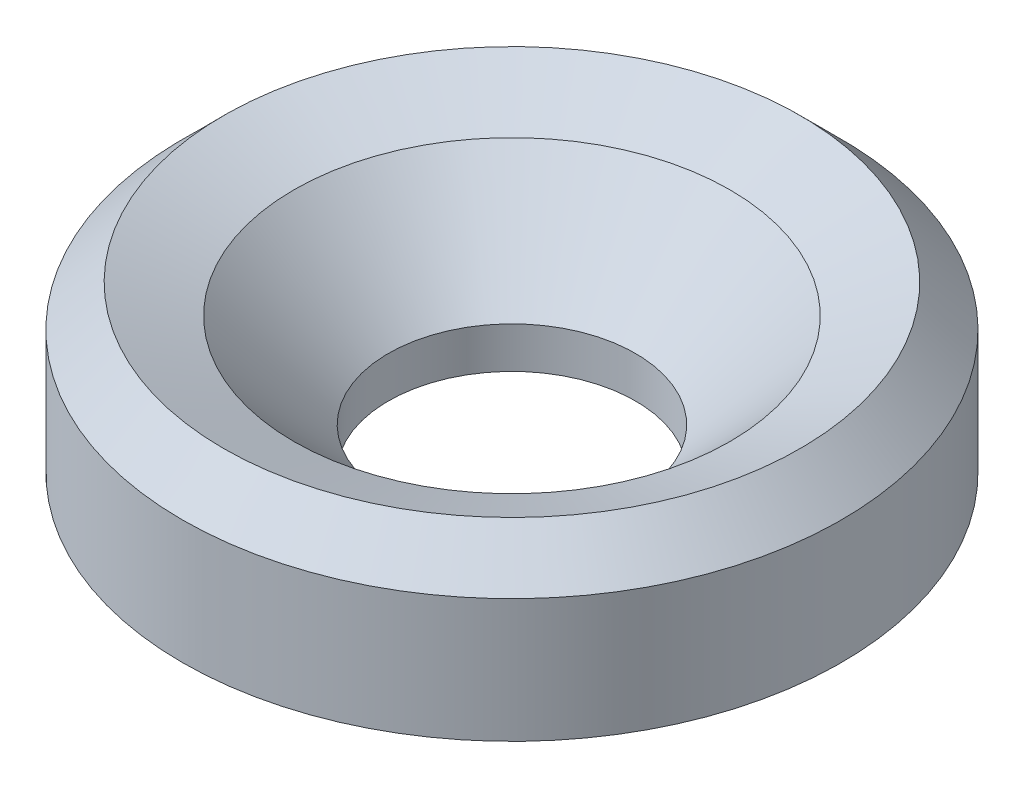
ISO-10303-21;
HEADER;
FILE_DESCRIPTION(('STEP AP214'),'2;1');
FILE_NAME('part.step','',(''),(''),'','','');
FILE_SCHEMA(('AUTOMOTIVE_DESIGN { 1 0 10303 214 1 1 1 1 }'));
ENDSEC;
DATA;
#1=APPLICATION_CONTEXT('core data for automotive mechanical design processes');
#2=APPLICATION_PROTOCOL_DEFINITION('international standard','automotive_design',2000,#1);
#3=PRODUCT_CONTEXT('',#1,'mechanical');
#4=PRODUCT('Part','Part','',(#3));
#5=PRODUCT_RELATED_PRODUCT_CATEGORY('part','',(#4));
#6=PRODUCT_DEFINITION_FORMATION('','',#4);
#7=PRODUCT_DEFINITION_CONTEXT('part definition',#1,'design');
#8=PRODUCT_DEFINITION('design','',#6,#7);
#9=PRODUCT_DEFINITION_SHAPE('','',#8);
#10=(LENGTH_UNIT() NAMED_UNIT(*) SI_UNIT(.MILLI.,.METRE.));
#11=(NAMED_UNIT(*) PLANE_ANGLE_UNIT() SI_UNIT($,.RADIAN.));
#12=(NAMED_UNIT(*) SI_UNIT($,.STERADIAN.) SOLID_ANGLE_UNIT());
#13=UNCERTAINTY_MEASURE_WITH_UNIT(LENGTH_MEASURE(1.E-05),#10,'distance_accuracy_value','');
#14=(GEOMETRIC_REPRESENTATION_CONTEXT(3) GLOBAL_UNCERTAINTY_ASSIGNED_CONTEXT((#13)) GLOBAL_UNIT_ASSIGNED_CONTEXT((#10,
#11,#12)) REPRESENTATION_CONTEXT('',''));
#15=CARTESIAN_POINT('',(0.,0.,0.));
#16=DIRECTION('',(0.,0.,1.));
#17=DIRECTION('',(1.,0.,0.));
#18=AXIS2_PLACEMENT_3D('',#15,#16,#17);
#19=CARTESIAN_POINT('',(0.,2.,0.));
#20=DIRECTION('',(0.,-1.,0.));
#21=DIRECTION('',(0.,0.,-1.));
#22=AXIS2_PLACEMENT_3D('',#19,#20,#21);
#23=CYLINDRICAL_SURFACE('',#22,4.);
#24=CARTESIAN_POINT('',(0.,1.5,0.));
#25=DIRECTION('',(0.,1.,0.));
#26=DIRECTION('',(0.,0.,1.));
#27=AXIS2_PLACEMENT_3D('',#24,#25,#26);
#28=CIRCLE('',#27,4.);
#29=CARTESIAN_POINT('',(0.,1.5,4.));
#30=VERTEX_POINT('',#29);
#31=EDGE_CURVE('E51',#30,#30,#28,.F.);
#32=ORIENTED_EDGE('',*,*,#31,.T.);
#33=EDGE_LOOP('',(#32));
#34=FACE_BOUND('',#33,.T.);
#35=CARTESIAN_POINT('',(0.,0.,0.));
#36=DIRECTION('',(0.,1.,0.));
#37=DIRECTION('',(0.,0.,1.));
#38=AXIS2_PLACEMENT_3D('',#35,#36,#37);
#39=CIRCLE('',#38,4.);
#40=CARTESIAN_POINT('',(0.,0.,4.));
#41=VERTEX_POINT('',#40);
#42=EDGE_CURVE('E62',#41,#41,#39,.T.);
#43=ORIENTED_EDGE('',*,*,#42,.T.);
#44=EDGE_LOOP('',(#43));
#45=FACE_BOUND('',#44,.T.);
#46=ADVANCED_FACE('F41',(#34,#45),#23,.T.);
#47=CARTESIAN_POINT('',(0.,0.,0.));
#48=DIRECTION('',(0.,1.,0.));
#49=DIRECTION('',(0.,0.,1.));
#50=AXIS2_PLACEMENT_3D('',#47,#48,#49);
#51=PLANE('',#50);
#52=CARTESIAN_POINT('',(0.,0.,0.));
#53=DIRECTION('',(0.,1.,0.));
#54=DIRECTION('',(0.,0.,1.));
#55=AXIS2_PLACEMENT_3D('',#52,#53,#54);
#56=CIRCLE('',#55,1.5);
#57=CARTESIAN_POINT('',(0.,0.,1.5));
#58=VERTEX_POINT('',#57);
#59=EDGE_CURVE('E66',#58,#58,#56,.T.);
#60=ORIENTED_EDGE('',*,*,#59,.T.);
#61=EDGE_LOOP('',(#60));
#62=FACE_BOUND('',#61,.T.);
#63=ORIENTED_EDGE('',*,*,#42,.F.);
#64=EDGE_LOOP('',(#63));
#65=FACE_BOUND('',#64,.T.);
#66=ADVANCED_FACE('F88',(#62,#65),#51,.F.);
#67=CARTESIAN_POINT('',(0.,0.,0.));
#68=DIRECTION('',(0.,1.,0.));
#69=DIRECTION('',(0.,0.,1.));
#70=AXIS2_PLACEMENT_3D('',#67,#68,#69);
#71=CYLINDRICAL_SURFACE('',#70,1.5);
#72=CARTESIAN_POINT('',(0.,0.499999999999991,0.));
#73=DIRECTION('',(0.,1.,0.));
#74=DIRECTION('',(0.,0.,1.));
#75=AXIS2_PLACEMENT_3D('',#72,#73,#74);
#76=CIRCLE('',#75,1.5);
#77=CARTESIAN_POINT('',(0.,0.499999999999991,1.5));
#78=VERTEX_POINT('',#77);
#79=EDGE_CURVE('E56',#78,#78,#76,.T.);
#80=ORIENTED_EDGE('',*,*,#79,.T.);
#81=EDGE_LOOP('',(#80));
#82=FACE_BOUND('',#81,.T.);
#83=ORIENTED_EDGE('',*,*,#59,.F.);
#84=EDGE_LOOP('',(#83));
#85=FACE_BOUND('',#84,.T.);
#86=ADVANCED_FACE('F85',(#82,#85),#71,.F.);
#87=CARTESIAN_POINT('',(0.,0.499999999999991,0.));
#88=DIRECTION('',(0.,1.,0.));
#89=DIRECTION('',(0.,0.,1.));
#90=AXIS2_PLACEMENT_3D('',#87,#88,#89);
#91=CONICAL_SURFACE('',#90,1.5,0.785398163397449);
#92=CARTESIAN_POINT('',(0.,1.64644660940672,0.));
#93=DIRECTION('',(0.,-1.,0.));
#94=DIRECTION('',(0.,0.,-1.));
#95=AXIS2_PLACEMENT_3D('',#92,#93,#94);
#96=CIRCLE('',#95,2.64644660940673);
#97=CARTESIAN_POINT('',(0.,1.64644660940672,2.64644660940673));
#98=VERTEX_POINT('',#97);
#99=EDGE_CURVE('E10',#98,#98,#96,.F.);
#100=CARTESIAN_POINT('',(0.,1.64644660940672,2.64644660940673));
#101=CARTESIAN_POINT('',(0.,1.6345044572254,2.63450445722541));
#102=CARTESIAN_POINT('',(0.,1.62256230504408,2.62256230504409));
#103=CARTESIAN_POINT('',(0.,1.59867800068144,2.59867800068145));
#104=CARTESIAN_POINT('',(0.,1.58673584850012,2.58673584850013));
#105=CARTESIAN_POINT('',(0.,1.56285154413748,2.56285154413749));
#106=CARTESIAN_POINT('',(0.,1.55090939195616,2.55090939195617));
#107=CARTESIAN_POINT('',(0.,1.52702508759352,2.52702508759353));
#108=CARTESIAN_POINT('',(0.,1.5150829354122,2.51508293541221));
#109=CARTESIAN_POINT('',(0.,1.49119863104956,2.49119863104957));
#110=CARTESIAN_POINT('',(0.,1.47925647886824,2.47925647886825));
#111=CARTESIAN_POINT('',(0.,1.4553721745056,2.45537217450561));
#112=CARTESIAN_POINT('',(0.,1.44343002232428,2.44343002232429));
#113=CARTESIAN_POINT('',(0.,1.41954571796164,2.41954571796165));
#114=CARTESIAN_POINT('',(0.,1.40760356578032,2.40760356578033));
#115=CARTESIAN_POINT('',(0.,1.38371926141768,2.38371926141769));
#116=CARTESIAN_POINT('',(0.,1.37177710923636,2.37177710923637));
#117=CARTESIAN_POINT('',(0.,1.34789280487372,2.34789280487373));
#118=CARTESIAN_POINT('',(0.,1.3359506526924,2.33595065269241));
#119=CARTESIAN_POINT('',(0.,1.31206634832976,2.31206634832977));
#120=CARTESIAN_POINT('',(0.,1.30012419614844,2.30012419614845));
#121=CARTESIAN_POINT('',(0.,1.2762398917858,2.27623989178581));
#122=CARTESIAN_POINT('',(0.,1.26429773960448,2.26429773960449));
#123=CARTESIAN_POINT('',(0.,1.24041343524184,2.24041343524185));
#124=CARTESIAN_POINT('',(0.,1.22847128306052,2.22847128306053));
#125=CARTESIAN_POINT('',(0.,1.20458697869788,2.20458697869789));
#126=CARTESIAN_POINT('',(0.,1.19264482651656,2.19264482651657));
#127=CARTESIAN_POINT('',(0.,1.16876052215392,2.16876052215393));
#128=CARTESIAN_POINT('',(0.,1.1568183699726,2.15681836997261));
#129=CARTESIAN_POINT('',(0.,1.13293406560996,2.13293406560997));
#130=CARTESIAN_POINT('',(0.,1.12099191342864,2.12099191342865));
#131=CARTESIAN_POINT('',(0.,1.097107609066,2.09710760906601));
#132=CARTESIAN_POINT('',(0.,1.08516545688468,2.08516545688469));
#133=CARTESIAN_POINT('',(0.,1.06128115252204,2.06128115252205));
#134=CARTESIAN_POINT('',(0.,1.04933900034072,2.04933900034073));
#135=CARTESIAN_POINT('',(0.,1.02545469597808,2.02545469597809));
#136=CARTESIAN_POINT('',(0.,1.01351254379676,2.01351254379677));
#137=CARTESIAN_POINT('',(0.,0.989628239434117,1.98962823943413));
#138=CARTESIAN_POINT('',(0.,0.977686087252796,1.97768608725281));
#139=CARTESIAN_POINT('',(0.,0.953801782890156,1.95380178289017));
#140=CARTESIAN_POINT('',(0.,0.941859630708836,1.94185963070885));
#141=CARTESIAN_POINT('',(0.,0.917975326346196,1.91797532634621));
#142=CARTESIAN_POINT('',(0.,0.906033174164876,1.90603317416488));
#143=CARTESIAN_POINT('',(0.,0.882148869802236,1.88214886980224));
#144=CARTESIAN_POINT('',(0.,0.870206717620915,1.87020671762092));
#145=CARTESIAN_POINT('',(0.,0.846322413258275,1.84632241325828));
#146=CARTESIAN_POINT('',(0.,0.834380261076955,1.83438026107696));
#147=CARTESIAN_POINT('',(0.,0.810495956714315,1.81049595671432));
#148=CARTESIAN_POINT('',(0.,0.798553804532995,1.798553804533));
#149=CARTESIAN_POINT('',(0.,0.774669500170354,1.77466950017036));
#150=CARTESIAN_POINT('',(0.,0.762727347989034,1.76272734798904));
#151=CARTESIAN_POINT('',(0.,0.738843043626394,1.7388430436264));
#152=CARTESIAN_POINT('',(0.,0.726900891445074,1.72690089144508));
#153=CARTESIAN_POINT('',(0.,0.703016587082434,1.70301658708244));
#154=CARTESIAN_POINT('',(0.,0.691074434901113,1.69107443490112));
#155=CARTESIAN_POINT('',(0.,0.667190130538473,1.66719013053848));
#156=CARTESIAN_POINT('',(0.,0.655247978357153,1.65524797835716));
#157=CARTESIAN_POINT('',(0.,0.631363673994513,1.63136367399452));
#158=CARTESIAN_POINT('',(0.,0.619421521813192,1.6194215218132));
#159=CARTESIAN_POINT('',(0.,0.595537217450552,1.59553721745056));
#160=CARTESIAN_POINT('',(0.,0.583595065269232,1.58359506526924));
#161=CARTESIAN_POINT('',(0.,0.559710760906592,1.5597107609066));
#162=CARTESIAN_POINT('',(0.,0.547768608725272,1.54776860872528));
#163=CARTESIAN_POINT('',(0.,0.523884304362631,1.52388430436264));
#164=CARTESIAN_POINT('',(0.,0.511942152181311,1.51194215218132));
#165=CARTESIAN_POINT('',(0.,0.499999999999991,1.5));
#166=B_SPLINE_CURVE_WITH_KNOTS('',3,(#100,#101,#102,#103,#104,#105,#106,#107,#108,#109,#110,
#111,#112,#113,#114,#115,#116,#117,#118,#119,#120,#121,#122,#123,#124,#125,#126,#127,#128,#129,
#130,#131,#132,#133,#134,#135,#136,#137,#138,#139,#140,#141,#142,#143,#144,#145,#146,#147,#148,
#149,#150,#151,#152,#153,#154,#155,#156,#157,#158,#159,#160,#161,#162,#163,#164,#165),
.UNSPECIFIED.,.F.,.F.,(4,2,2,2,2,2,2,2,2,2,2,2,2,2,2,2,2,2,2,2,2,2,2,2,2,2,2,2,2,2,2,2,4),(0.,
0.0506662607362394,0.101332521472478,0.151998782208717,0.202665042944956,0.253331303681195,
0.303997564417435,0.354663825153674,0.405330085889913,0.455996346626152,0.506662607362391,
0.55732886809863,0.60799512883487,0.658661389571109,0.709327650307348,0.759993911043587,
0.810660171779826,0.861326432516065,0.911992693252304,0.962658953988544,1.01332521472478,
1.06399147546102,1.11465773619726,1.1653239969335,1.21599025766974,1.26665651840598,
1.31732277914222,1.36798903987846,1.4186553006147,1.46932156135093,1.51998782208717,
1.57065408282341,1.62132034355965),.UNSPECIFIED.);
#167=EDGE_CURVE('BSEAM78',#98,#78,#166,.T.);
#168=ORIENTED_EDGE('',*,*,#99,.T.);
#169=ORIENTED_EDGE('',*,*,#79,.F.);
#170=ORIENTED_EDGE('',*,*,#167,.T.);
#171=ORIENTED_EDGE('',*,*,#167,.F.);
#172=EDGE_LOOP('',(#168,#170,#169,#171));
#173=FACE_BOUND('',#172,.T.);
#174=ADVANCED_FACE('F78',(#173),#91,.F.);
#175=CARTESIAN_POINT('',(0.,2.,0.));
#176=DIRECTION('',(0.,1.,0.));
#177=DIRECTION('',(0.,0.,1.));
#178=AXIS2_PLACEMENT_3D('',#175,#176,#177);
#179=CONICAL_SURFACE('',#178,3.50000000000001,1.17809724509617);
#180=ORIENTED_EDGE('',*,*,#99,.F.);
#181=EDGE_LOOP('',(#180));
#182=FACE_BOUND('',#181,.T.);
#183=CARTESIAN_POINT('',(0.,2.,0.));
#184=DIRECTION('',(0.,1.,0.));
#185=DIRECTION('',(0.,0.,1.));
#186=AXIS2_PLACEMENT_3D('',#183,#184,#185);
#187=CIRCLE('',#186,3.50000000000001);
#188=CARTESIAN_POINT('',(0.,2.,3.50000000000001));
#189=VERTEX_POINT('',#188);
#190=EDGE_CURVE('E46',#189,#189,#187,.F.);
#191=ORIENTED_EDGE('',*,*,#190,.F.);
#192=EDGE_LOOP('',(#191));
#193=FACE_BOUND('',#192,.T.);
#194=ADVANCED_FACE('F44',(#182,#193),#179,.F.);
#195=CARTESIAN_POINT('',(0.,2.,0.));
#196=DIRECTION('',(0.,-1.,0.));
#197=DIRECTION('',(0.,0.,-1.));
#198=AXIS2_PLACEMENT_3D('',#195,#196,#197);
#199=CONICAL_SURFACE('',#198,3.5,0.785398163397448);
#200=ORIENTED_EDGE('',*,*,#31,.F.);
#201=EDGE_LOOP('',(#200));
#202=FACE_BOUND('',#201,.T.);
#203=ORIENTED_EDGE('',*,*,#190,.T.);
#204=EDGE_LOOP('',(#203));
#205=FACE_BOUND('',#204,.T.);
#206=ADVANCED_FACE('F75',(#202,#205),#199,.T.);
#207=CLOSED_SHELL('',(#46,#66,#86,#174,#194,#206));
#208=MANIFOLD_SOLID_BREP('B2',#207);
#209=ADVANCED_BREP_SHAPE_REPRESENTATION('',(#18,#208),#14);
#210=SHAPE_DEFINITION_REPRESENTATION(#9,#209);
ENDSEC;
END-ISO-10303-21;
